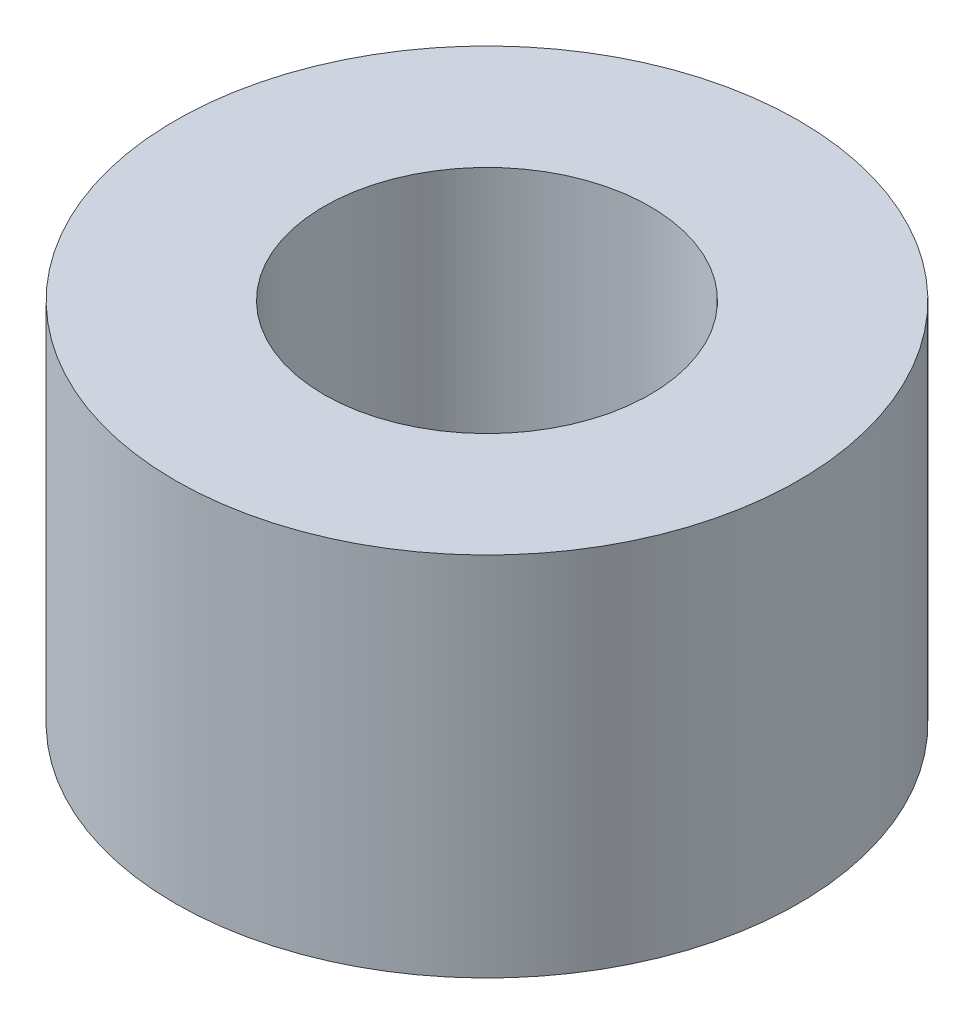
ISO-10303-21;
HEADER;
FILE_DESCRIPTION(('STEP AP214'),'2;1');
FILE_NAME('part.step','',(''),(''),'','','');
FILE_SCHEMA(('AUTOMOTIVE_DESIGN { 1 0 10303 214 1 1 1 1 }'));
ENDSEC;
DATA;
#1=APPLICATION_CONTEXT('core data for automotive mechanical design processes');
#2=APPLICATION_PROTOCOL_DEFINITION('international standard','automotive_design',2000,#1);
#3=PRODUCT_CONTEXT('',#1,'mechanical');
#4=PRODUCT('Part','Part','',(#3));
#5=PRODUCT_RELATED_PRODUCT_CATEGORY('part','',(#4));
#6=PRODUCT_DEFINITION_FORMATION('','',#4);
#7=PRODUCT_DEFINITION_CONTEXT('part definition',#1,'design');
#8=PRODUCT_DEFINITION('design','',#6,#7);
#9=PRODUCT_DEFINITION_SHAPE('','',#8);
#10=(LENGTH_UNIT() NAMED_UNIT(*) SI_UNIT(.MILLI.,.METRE.));
#11=(NAMED_UNIT(*) PLANE_ANGLE_UNIT() SI_UNIT($,.RADIAN.));
#12=(NAMED_UNIT(*) SI_UNIT($,.STERADIAN.) SOLID_ANGLE_UNIT());
#13=UNCERTAINTY_MEASURE_WITH_UNIT(LENGTH_MEASURE(1.E-05),#10,'distance_accuracy_value','');
#14=(GEOMETRIC_REPRESENTATION_CONTEXT(3) GLOBAL_UNCERTAINTY_ASSIGNED_CONTEXT((#13)) GLOBAL_UNIT_ASSIGNED_CONTEXT((#10,
#11,#12)) REPRESENTATION_CONTEXT('',''));
#15=CARTESIAN_POINT('',(0.,0.,0.));
#16=DIRECTION('',(0.,0.,1.));
#17=DIRECTION('',(1.,0.,0.));
#18=AXIS2_PLACEMENT_3D('',#15,#16,#17);
#19=CARTESIAN_POINT('',(0.,2.5,0.));
#20=DIRECTION('',(0.,1.,0.));
#21=DIRECTION('',(0.,0.,1.));
#22=AXIS2_PLACEMENT_3D('',#19,#20,#21);
#23=PLANE('',#22);
#24=CARTESIAN_POINT('',(0.,2.5,0.));
#25=DIRECTION('',(0.,1.,0.));
#26=DIRECTION('',(0.,0.,1.));
#27=AXIS2_PLACEMENT_3D('',#24,#25,#26);
#28=CIRCLE('',#27,4.255);
#29=CARTESIAN_POINT('',(0.,2.5,4.255));
#30=VERTEX_POINT('',#29);
#31=EDGE_CURVE('E10',#30,#30,#28,.T.);
#32=ORIENTED_EDGE('',*,*,#31,.T.);
#33=EDGE_LOOP('',(#32));
#34=FACE_BOUND('',#33,.T.);
#35=CARTESIAN_POINT('',(0.,2.5,0.));
#36=DIRECTION('',(0.,1.,0.));
#37=DIRECTION('',(0.,0.,1.));
#38=AXIS2_PLACEMENT_3D('',#35,#36,#37);
#39=CIRCLE('',#38,2.225);
#40=CARTESIAN_POINT('',(0.,2.5,2.225));
#41=VERTEX_POINT('',#40);
#42=EDGE_CURVE('E50',#41,#41,#39,.T.);
#43=ORIENTED_EDGE('',*,*,#42,.F.);
#44=EDGE_LOOP('',(#43));
#45=FACE_BOUND('',#44,.T.);
#46=ADVANCED_FACE('F37',(#34,#45),#23,.T.);
#47=CARTESIAN_POINT('',(0.,-2.5,0.));
#48=DIRECTION('',(0.,1.,0.));
#49=DIRECTION('',(0.,0.,1.));
#50=AXIS2_PLACEMENT_3D('',#47,#48,#49);
#51=PLANE('',#50);
#52=CARTESIAN_POINT('',(0.,-2.5,0.));
#53=DIRECTION('',(0.,1.,0.));
#54=DIRECTION('',(0.,0.,1.));
#55=AXIS2_PLACEMENT_3D('',#52,#53,#54);
#56=CIRCLE('',#55,4.255);
#57=CARTESIAN_POINT('',(0.,-2.5,4.255));
#58=VERTEX_POINT('',#57);
#59=EDGE_CURVE('E41',#58,#58,#56,.T.);
#60=ORIENTED_EDGE('',*,*,#59,.F.);
#61=EDGE_LOOP('',(#60));
#62=FACE_BOUND('',#61,.T.);
#63=CARTESIAN_POINT('',(0.,-2.5,0.));
#64=DIRECTION('',(0.,1.,0.));
#65=DIRECTION('',(0.,0.,1.));
#66=AXIS2_PLACEMENT_3D('',#63,#64,#65);
#67=CIRCLE('',#66,2.225);
#68=CARTESIAN_POINT('',(0.,-2.5,2.225));
#69=VERTEX_POINT('',#68);
#70=EDGE_CURVE('E52',#69,#69,#67,.T.);
#71=ORIENTED_EDGE('',*,*,#70,.T.);
#72=EDGE_LOOP('',(#71));
#73=FACE_BOUND('',#72,.T.);
#74=ADVANCED_FACE('F64',(#62,#73),#51,.F.);
#75=CARTESIAN_POINT('',(0.,2.5,0.));
#76=DIRECTION('',(0.,-1.,0.));
#77=DIRECTION('',(0.,0.,-1.));
#78=AXIS2_PLACEMENT_3D('',#75,#76,#77);
#79=CYLINDRICAL_SURFACE('',#78,4.255);
#80=ORIENTED_EDGE('',*,*,#31,.F.);
#81=EDGE_LOOP('',(#80));
#82=FACE_BOUND('',#81,.T.);
#83=ORIENTED_EDGE('',*,*,#59,.T.);
#84=EDGE_LOOP('',(#83));
#85=FACE_BOUND('',#84,.T.);
#86=ADVANCED_FACE('F39',(#82,#85),#79,.T.);
#87=CARTESIAN_POINT('',(0.,2.5,0.));
#88=DIRECTION('',(0.,-1.,0.));
#89=DIRECTION('',(0.,0.,-1.));
#90=AXIS2_PLACEMENT_3D('',#87,#88,#89);
#91=CYLINDRICAL_SURFACE('',#90,2.225);
#92=ORIENTED_EDGE('',*,*,#42,.T.);
#93=EDGE_LOOP('',(#92));
#94=FACE_BOUND('',#93,.T.);
#95=ORIENTED_EDGE('',*,*,#70,.F.);
#96=EDGE_LOOP('',(#95));
#97=FACE_BOUND('',#96,.T.);
#98=ADVANCED_FACE('F60',(#94,#97),#91,.F.);
#99=CLOSED_SHELL('',(#46,#74,#86,#98));
#100=MANIFOLD_SOLID_BREP('B2',#99);
#101=ADVANCED_BREP_SHAPE_REPRESENTATION('',(#18,#100),#14);
#102=SHAPE_DEFINITION_REPRESENTATION(#9,#101);
ENDSEC;
END-ISO-10303-21;
